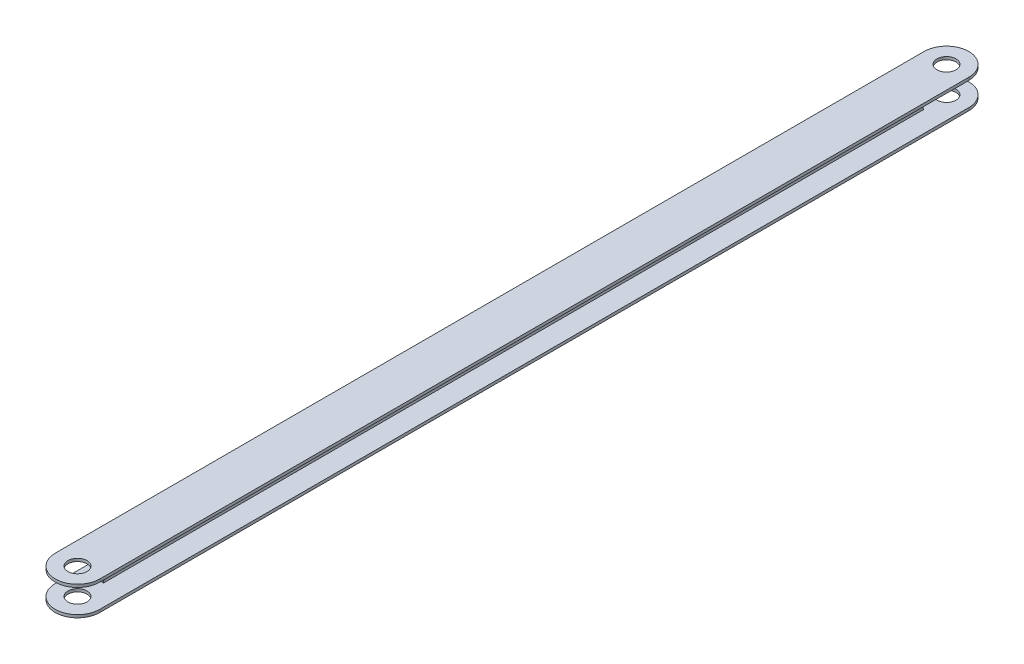
ISO-10303-21;
HEADER;
FILE_DESCRIPTION(('STEP AP214'),'2;1');
FILE_NAME('part.step','',(''),(''),'','','');
FILE_SCHEMA(('AUTOMOTIVE_DESIGN { 1 0 10303 214 1 1 1 1 }'));
ENDSEC;
DATA;
#1=APPLICATION_CONTEXT('core data for automotive mechanical design processes');
#2=APPLICATION_PROTOCOL_DEFINITION('international standard','automotive_design',2000,#1);
#3=PRODUCT_CONTEXT('',#1,'mechanical');
#4=PRODUCT('Part','Part','',(#3));
#5=PRODUCT_RELATED_PRODUCT_CATEGORY('part','',(#4));
#6=PRODUCT_DEFINITION_FORMATION('','',#4);
#7=PRODUCT_DEFINITION_CONTEXT('part definition',#1,'design');
#8=PRODUCT_DEFINITION('design','',#6,#7);
#9=PRODUCT_DEFINITION_SHAPE('','',#8);
#10=(LENGTH_UNIT() NAMED_UNIT(*) SI_UNIT(.MILLI.,.METRE.));
#11=(NAMED_UNIT(*) PLANE_ANGLE_UNIT() SI_UNIT($,.RADIAN.));
#12=(NAMED_UNIT(*) SI_UNIT($,.STERADIAN.) SOLID_ANGLE_UNIT());
#13=UNCERTAINTY_MEASURE_WITH_UNIT(LENGTH_MEASURE(1.E-05),#10,'distance_accuracy_value','');
#14=(GEOMETRIC_REPRESENTATION_CONTEXT(3) GLOBAL_UNCERTAINTY_ASSIGNED_CONTEXT((#13)) GLOBAL_UNIT_ASSIGNED_CONTEXT((#10,
#11,#12)) REPRESENTATION_CONTEXT('',''));
#15=CARTESIAN_POINT('',(0.,0.,0.));
#16=DIRECTION('',(0.,0.,1.));
#17=DIRECTION('',(1.,0.,0.));
#18=AXIS2_PLACEMENT_3D('',#15,#16,#17);
#19=CARTESIAN_POINT('',(-0.599999999999684,1.66533453693773E-12,389.000000000002));
#20=DIRECTION('',(1.,0.,0.));
#21=DIRECTION('',(0.,0.999999999999998,0.));
#22=AXIS2_PLACEMENT_3D('',#19,#20,#21);
#23=PLANE('',#22);
#24=DIRECTION('',(0.,0.999999999999998,0.));
#25=VECTOR('',#24,1.);
#26=CARTESIAN_POINT('',(-0.599999999999684,1.66533453693773E-12,369.000000000002));
#27=LINE('',#26,#25);
#28=CARTESIAN_POINT('',(-0.599999999999629,-5.,369.000000000002));
#29=VERTEX_POINT('',#28);
#30=CARTESIAN_POINT('',(-0.599999999999462,-4.51763554259088,369.000000000002));
#31=VERTEX_POINT('',#30);
#32=EDGE_CURVE('E232',#29,#31,#27,.T.);
#33=ORIENTED_EDGE('',*,*,#32,.T.);
#34=CARTESIAN_POINT('',(-0.599999999999823,-4.51763554259244,368.000000000002));
#35=DIRECTION('',(1.,0.,0.));
#36=DIRECTION('',(0.,-0.999999999999998,0.));
#37=AXIS2_PLACEMENT_3D('',#34,#35,#36);
#38=CIRCLE('',#37,1.);
#39=CARTESIAN_POINT('',(-0.599999999999656,-3.61410843407284,368.428530937243));
#40=VERTEX_POINT('',#39);
#41=EDGE_CURVE('E516',#31,#40,#38,.F.);
#42=ORIENTED_EDGE('',*,*,#41,.T.);
#43=CARTESIAN_POINT('',(-0.599999999999656,1.55431223447522E-12,370.142654686205));
#44=DIRECTION('',(1.,0.,0.));
#45=DIRECTION('',(0.,-0.999999999999998,0.));
#46=AXIS2_PLACEMENT_3D('',#43,#44,#45);
#47=CIRCLE('',#46,4.);
#48=CARTESIAN_POINT('',(-0.599999999999906,3.61410843407561,368.428530937242));
#49=VERTEX_POINT('',#48);
#50=EDGE_CURVE('E286',#40,#49,#47,.T.);
#51=ORIENTED_EDGE('',*,*,#50,.T.);
#52=CARTESIAN_POINT('',(-0.599999999999379,4.5176355425941,368.000000000002));
#53=DIRECTION('',(1.,0.,0.));
#54=DIRECTION('',(0.,-0.999999999999998,0.));
#55=AXIS2_PLACEMENT_3D('',#52,#53,#54);
#56=CIRCLE('',#55,1.);
#57=CARTESIAN_POINT('',(-0.599999999999296,4.5176355425941,369.000000000002));
#58=VERTEX_POINT('',#57);
#59=EDGE_CURVE('E241',#49,#58,#56,.F.);
#60=ORIENTED_EDGE('',*,*,#59,.T.);
#61=DIRECTION('',(0.,0.999999999999998,0.));
#62=VECTOR('',#61,1.);
#63=CARTESIAN_POINT('',(-0.599999999999684,1.66533453693773E-12,369.000000000002));
#64=LINE('',#63,#62);
#65=CARTESIAN_POINT('',(-0.599999999998851,5.,369.000000000002));
#66=VERTEX_POINT('',#65);
#67=EDGE_CURVE('E224',#58,#66,#64,.T.);
#68=ORIENTED_EDGE('',*,*,#67,.T.);
#69=DIRECTION('',(0.,0.,-1.00000000000001));
#70=VECTOR('',#69,1.);
#71=CARTESIAN_POINT('',(-0.59999999999924,5.00000000000167,389.000000000002));
#72=LINE('',#71,#70);
#73=CARTESIAN_POINT('',(-0.599999999999684,5.00000000000167,20.));
#74=VERTEX_POINT('',#73);
#75=EDGE_CURVE('E237',#66,#74,#72,.T.);
#76=ORIENTED_EDGE('',*,*,#75,.T.);
#77=DIRECTION('',(0.,0.999999999999998,0.));
#78=VECTOR('',#77,1.);
#79=CARTESIAN_POINT('',(-0.600000000000017,1.66533453693773E-12,20.0000000000005));
#80=LINE('',#79,#78);
#81=CARTESIAN_POINT('',(-0.600000000000156,4.5176355425941,20.0000000000007));
#82=VERTEX_POINT('',#81);
#83=EDGE_CURVE('E309',#82,#74,#80,.T.);
#84=ORIENTED_EDGE('',*,*,#83,.F.);
#85=CARTESIAN_POINT('',(-0.599999999999962,4.51763554259421,21.0000000000004));
#86=DIRECTION('',(-1.,0.,0.));
#87=DIRECTION('',(0.,-0.999999999999998,0.));
#88=AXIS2_PLACEMENT_3D('',#85,#86,#87);
#89=CIRCLE('',#88,1.);
#90=CARTESIAN_POINT('',(-0.599999999999851,3.61410843407406,20.5714690627595));
#91=VERTEX_POINT('',#90);
#92=EDGE_CURVE('E306',#91,#82,#89,.F.);
#93=ORIENTED_EDGE('',*,*,#92,.F.);
#94=CARTESIAN_POINT('',(-0.600000000000156,1.66533453693773E-12,18.857345313798));
#95=DIRECTION('',(-1.,0.,0.));
#96=DIRECTION('',(0.,-0.999999999999998,0.));
#97=AXIS2_PLACEMENT_3D('',#94,#95,#96);
#98=CIRCLE('',#97,4.);
#99=CARTESIAN_POINT('',(-0.599999999999989,-3.61410843407239,20.5714690627596));
#100=VERTEX_POINT('',#99);
#101=EDGE_CURVE('E303',#100,#91,#98,.T.);
#102=ORIENTED_EDGE('',*,*,#101,.F.);
#103=CARTESIAN_POINT('',(-0.600000000000017,-4.51763554259088,21.0000000000009));
#104=DIRECTION('',(-1.,0.,0.));
#105=DIRECTION('',(0.,-0.999999999999998,0.));
#106=AXIS2_PLACEMENT_3D('',#103,#104,#105);
#107=CIRCLE('',#106,1.);
#108=CARTESIAN_POINT('',(-0.599999999999906,-4.51763554259077,20.0000000000002));
#109=VERTEX_POINT('',#108);
#110=EDGE_CURVE('E300',#109,#100,#107,.F.);
#111=ORIENTED_EDGE('',*,*,#110,.F.);
#112=DIRECTION('',(0.,0.999999999999998,0.));
#113=VECTOR('',#112,1.);
#114=CARTESIAN_POINT('',(-0.600000000000017,1.66533453693773E-12,20.0000000000005));
#115=LINE('',#114,#113);
#116=CARTESIAN_POINT('',(-0.599999999999989,-5.,20.));
#117=VERTEX_POINT('',#116);
#118=EDGE_CURVE('E297',#117,#109,#115,.T.);
#119=ORIENTED_EDGE('',*,*,#118,.F.);
#120=DIRECTION('',(0.,0.,-1.00000000000001));
#121=VECTOR('',#120,1.);
#122=CARTESIAN_POINT('',(-0.599999999999684,-4.99999999999834,389.000000000002));
#123=LINE('',#122,#121);
#124=EDGE_CURVE('E249',#29,#117,#123,.T.);
#125=ORIENTED_EDGE('',*,*,#124,.F.);
#126=EDGE_LOOP('',(#33,#42,#51,#60,#68,#76,#84,#93,#102,#111,#119,#125));
#127=FACE_BOUND('',#126,.T.);
#128=ADVANCED_FACE('F81',(#127),#23,.F.);
#129=CARTESIAN_POINT('',(0.600000000000572,0.,389.000000000002));
#130=DIRECTION('',(1.,0.,0.));
#131=DIRECTION('',(0.,0.999999999999998,0.));
#132=AXIS2_PLACEMENT_3D('',#129,#130,#131);
#133=PLANE('',#132);
#134=CARTESIAN_POINT('',(0.600000000000322,-4.51763554259188,368.000000000002));
#135=DIRECTION('',(1.,0.,0.));
#136=DIRECTION('',(0.,0.999999999999998,0.));
#137=AXIS2_PLACEMENT_3D('',#134,#135,#136);
#138=CIRCLE('',#137,1.);
#139=CARTESIAN_POINT('',(0.600000000000739,-3.61410843407228,368.428530937243));
#140=VERTEX_POINT('',#139);
#141=CARTESIAN_POINT('',(0.600000000000322,-4.51763554259088,369.000000000001));
#142=VERTEX_POINT('',#141);
#143=EDGE_CURVE('E89',#140,#142,#138,.T.);
#144=ORIENTED_EDGE('',*,*,#143,.T.);
#145=DIRECTION('',(0.,-0.999999999999998,0.));
#146=VECTOR('',#145,1.);
#147=CARTESIAN_POINT('',(0.600000000000822,1.66533453693773E-12,369.000000000001));
#148=LINE('',#147,#146);
#149=CARTESIAN_POINT('',(0.600000000000739,-5.,369.000000000001));
#150=VERTEX_POINT('',#149);
#151=EDGE_CURVE('E14',#142,#150,#148,.T.);
#152=ORIENTED_EDGE('',*,*,#151,.T.);
#153=DIRECTION('',(0.,0.,-1.00000000000001));
#154=VECTOR('',#153,1.);
#155=CARTESIAN_POINT('',(0.600000000000572,-5.,389.000000000002));
#156=LINE('',#155,#154);
#157=CARTESIAN_POINT('',(0.600000000000572,-5.,20.0000000000008));
#158=VERTEX_POINT('',#157);
#159=EDGE_CURVE('E388',#150,#158,#156,.T.);
#160=ORIENTED_EDGE('',*,*,#159,.T.);
#161=DIRECTION('',(0.,-0.999999999999998,0.));
#162=VECTOR('',#161,1.);
#163=CARTESIAN_POINT('',(0.600000000000461,1.66533453693773E-12,20.0000000000012));
#164=LINE('',#163,#162);
#165=CARTESIAN_POINT('',(0.59999999999974,-4.51763554259255,20.0000000000008));
#166=VERTEX_POINT('',#165);
#167=EDGE_CURVE('E252',#166,#158,#164,.T.);
#168=ORIENTED_EDGE('',*,*,#167,.F.);
#169=CARTESIAN_POINT('',(0.600000000000406,-4.51763554259244,21.));
#170=DIRECTION('',(1.,0.,0.));
#171=DIRECTION('',(0.,0.999999999999998,0.));
#172=AXIS2_PLACEMENT_3D('',#169,#170,#171);
#173=CIRCLE('',#172,1.);
#174=CARTESIAN_POINT('',(0.600000000000406,-3.61410843407395,20.5714690627605));
#175=VERTEX_POINT('',#174);
#176=EDGE_CURVE('E260',#175,#166,#173,.F.);
#177=ORIENTED_EDGE('',*,*,#176,.F.);
#178=CARTESIAN_POINT('',(0.600000000000378,1.11022302462516E-12,18.8573453137987));
#179=DIRECTION('',(1.,0.,0.));
#180=DIRECTION('',(0.,0.999999999999998,0.));
#181=AXIS2_PLACEMENT_3D('',#178,#179,#180);
#182=CIRCLE('',#181,4.);
#183=CARTESIAN_POINT('',(0.6000000000006,3.61410843407561,20.5714690627596));
#184=VERTEX_POINT('',#183);
#185=EDGE_CURVE('E262',#184,#175,#182,.T.);
#186=ORIENTED_EDGE('',*,*,#185,.F.);
#187=CARTESIAN_POINT('',(0.600000000000406,4.51763554259421,21.0000000000003));
#188=DIRECTION('',(1.,0.,0.));
#189=DIRECTION('',(0.,0.999999999999998,0.));
#190=AXIS2_PLACEMENT_3D('',#187,#188,#189);
#191=CIRCLE('',#190,1.);
#192=CARTESIAN_POINT('',(0.600000000000017,4.5176355425941,20.0000000000006));
#193=VERTEX_POINT('',#192);
#194=EDGE_CURVE('E264',#193,#184,#191,.F.);
#195=ORIENTED_EDGE('',*,*,#194,.F.);
#196=DIRECTION('',(0.,-0.999999999999998,0.));
#197=VECTOR('',#196,1.);
#198=CARTESIAN_POINT('',(0.600000000000461,1.66533453693773E-12,20.0000000000012));
#199=LINE('',#198,#197);
#200=CARTESIAN_POINT('',(0.600000000000156,5.,20.0000000000008));
#201=VERTEX_POINT('',#200);
#202=EDGE_CURVE('E313',#201,#193,#199,.T.);
#203=ORIENTED_EDGE('',*,*,#202,.F.);
#204=DIRECTION('',(0.,0.,-1.00000000000001));
#205=VECTOR('',#204,1.);
#206=CARTESIAN_POINT('',(0.600000000000572,5.,389.000000000002));
#207=LINE('',#206,#205);
#208=CARTESIAN_POINT('',(0.600000000000739,5.,369.000000000002));
#209=VERTEX_POINT('',#208);
#210=EDGE_CURVE('E386',#209,#201,#207,.T.);
#211=ORIENTED_EDGE('',*,*,#210,.F.);
#212=DIRECTION('',(0.,-0.999999999999998,0.));
#213=VECTOR('',#212,1.);
#214=CARTESIAN_POINT('',(0.600000000000822,1.66533453693773E-12,369.000000000001));
#215=LINE('',#214,#213);
#216=CARTESIAN_POINT('',(0.600000000000322,4.51763554259255,369.000000000002));
#217=VERTEX_POINT('',#216);
#218=EDGE_CURVE('E227',#209,#217,#215,.T.);
#219=ORIENTED_EDGE('',*,*,#218,.T.);
#220=CARTESIAN_POINT('',(0.600000000000267,4.5176355425941,368.000000000001));
#221=DIRECTION('',(1.,0.,0.));
#222=DIRECTION('',(0.,0.999999999999998,0.));
#223=AXIS2_PLACEMENT_3D('',#220,#221,#222);
#224=CIRCLE('',#223,1.);
#225=CARTESIAN_POINT('',(0.600000000000406,3.61410843407561,368.428530937243));
#226=VERTEX_POINT('',#225);
#227=EDGE_CURVE('E266',#217,#226,#224,.T.);
#228=ORIENTED_EDGE('',*,*,#227,.T.);
#229=CARTESIAN_POINT('',(0.600000000000739,1.66533453693773E-12,370.142654686205));
#230=DIRECTION('',(1.,0.,0.));
#231=DIRECTION('',(0.,0.999999999999998,0.));
#232=AXIS2_PLACEMENT_3D('',#229,#230,#231);
#233=CIRCLE('',#232,4.);
#234=EDGE_CURVE('E269',#226,#140,#233,.F.);
#235=ORIENTED_EDGE('',*,*,#234,.T.);
#236=EDGE_LOOP('',(#144,#152,#160,#168,#177,#186,#195,#203,#211,#219,#228,#235));
#237=FACE_BOUND('',#236,.T.);
#238=ADVANCED_FACE('F273',(#237),#133,.T.);
#239=CARTESIAN_POINT('',(7.21644966006352E-13,-363.799999999999,379.500000000002));
#240=DIRECTION('',(0.,0.999999999999998,0.));
#241=DIRECTION('',(0.,0.,1.00000000000001));
#242=AXIS2_PLACEMENT_3D('',#239,#240,#241);
#243=CYLINDRICAL_SURFACE('',#242,9.49999999999999);
#244=CARTESIAN_POINT('',(1.38777878078145E-13,5.00000000000023,379.500000000003));
#245=DIRECTION('',(0.,0.999999999999998,0.));
#246=DIRECTION('',(0.,0.,1.00000000000001));
#247=AXIS2_PLACEMENT_3D('',#244,#245,#246);
#248=CIRCLE('',#247,9.49999999999999);
#249=CARTESIAN_POINT('',(9.5000000000007,5.00000000000167,379.500000000002));
#250=VERTEX_POINT('',#249);
#251=CARTESIAN_POINT('',(-9.49999999999962,5.,379.500000000003));
#252=VERTEX_POINT('',#251);
#253=EDGE_CURVE('E96',#250,#252,#248,.F.);
#254=ORIENTED_EDGE('',*,*,#253,.F.);
#255=DIRECTION('',(0.,0.999999999999998,0.));
#256=VECTOR('',#255,1.);
#257=CARTESIAN_POINT('',(9.50000000000068,-363.799999999998,379.500000000003));
#258=LINE('',#257,#256);
#259=CARTESIAN_POINT('',(9.50000000000034,6.19999999999998,379.500000000003));
#260=VERTEX_POINT('',#259);
#261=EDGE_CURVE('E331',#250,#260,#258,.T.);
#262=ORIENTED_EDGE('',*,*,#261,.T.);
#263=CARTESIAN_POINT('',(2.77555756156289E-13,6.20000000000154,379.500000000003));
#264=DIRECTION('',(0.,-0.999999999999998,0.));
#265=DIRECTION('',(0.,0.,-1.00000000000001));
#266=AXIS2_PLACEMENT_3D('',#263,#264,#265);
#267=CIRCLE('',#266,9.49999999999999);
#268=CARTESIAN_POINT('',(-9.49999999999912,6.20000000000165,379.500000000002));
#269=VERTEX_POINT('',#268);
#270=EDGE_CURVE('E328',#260,#269,#267,.T.);
#271=ORIENTED_EDGE('',*,*,#270,.T.);
#272=DIRECTION('',(0.,0.999999999999998,0.));
#273=VECTOR('',#272,1.);
#274=CARTESIAN_POINT('',(-9.49999999999962,-363.799999999999,379.500000000003));
#275=LINE('',#274,#273);
#276=EDGE_CURVE('E330',#252,#269,#275,.T.);
#277=ORIENTED_EDGE('',*,*,#276,.F.);
#278=EDGE_LOOP('',(#254,#262,#271,#277));
#279=FACE_BOUND('',#278,.T.);
#280=ADVANCED_FACE('F425',(#279),#243,.T.);
#281=CARTESIAN_POINT('',(7.21644966006352E-13,-363.799999999999,379.500000000002));
#282=DIRECTION('',(0.,0.999999999999998,0.));
#283=DIRECTION('',(0.,0.,1.00000000000001));
#284=AXIS2_PLACEMENT_3D('',#281,#282,#283);
#285=CYLINDRICAL_SURFACE('',#284,4.05);
#286=CARTESIAN_POINT('',(2.77555756156289E-13,6.20000000000154,379.500000000003));
#287=DIRECTION('',(0.,-0.999999999999998,0.));
#288=DIRECTION('',(0.,0.,-1.00000000000001));
#289=AXIS2_PLACEMENT_3D('',#286,#287,#288);
#290=CIRCLE('',#289,4.05);
#291=CARTESIAN_POINT('',(2.74732029186269E-13,6.20000000000154,375.450000000003));
#292=VERTEX_POINT('',#291);
#293=EDGE_CURVE('E325',#292,#292,#290,.T.);
#294=ORIENTED_EDGE('',*,*,#293,.F.);
#295=EDGE_LOOP('',(#294));
#296=FACE_BOUND('',#295,.T.);
#297=CARTESIAN_POINT('',(1.38777878078145E-13,5.00000000000023,379.500000000003));
#298=DIRECTION('',(0.,0.999999999999998,0.));
#299=DIRECTION('',(0.,0.,1.00000000000001));
#300=AXIS2_PLACEMENT_3D('',#297,#298,#299);
#301=CIRCLE('',#300,4.05);
#302=CARTESIAN_POINT('',(1.41601605048165E-13,5.00000000000023,383.550000000003));
#303=VERTEX_POINT('',#302);
#304=EDGE_CURVE('E348',#303,#303,#301,.F.);
#305=ORIENTED_EDGE('',*,*,#304,.T.);
#306=EDGE_LOOP('',(#305));
#307=FACE_BOUND('',#306,.T.);
#308=ADVANCED_FACE('F433',(#296,#307),#285,.F.);
#309=CARTESIAN_POINT('',(0.,-363.799999999999,9.49999999999967));
#310=DIRECTION('',(0.,0.999999999999998,0.));
#311=DIRECTION('',(0.,0.,1.00000000000001));
#312=AXIS2_PLACEMENT_3D('',#309,#310,#311);
#313=CYLINDRICAL_SURFACE('',#312,9.49999999999999);
#314=CARTESIAN_POINT('',(8.32667268468867E-13,-4.99999999999923,9.50000000000084));
#315=DIRECTION('',(0.,0.999999999999998,0.));
#316=DIRECTION('',(0.,0.,1.00000000000001));
#317=AXIS2_PLACEMENT_3D('',#314,#315,#316);
#318=CIRCLE('',#317,9.49999999999999);
#319=CARTESIAN_POINT('',(9.50000000000042,-4.99999999999834,9.50000000000017));
#320=VERTEX_POINT('',#319);
#321=CARTESIAN_POINT('',(-9.49999999999912,-5.,9.50000000000001));
#322=VERTEX_POINT('',#321);
#323=EDGE_CURVE('E367',#320,#322,#318,.T.);
#324=ORIENTED_EDGE('',*,*,#323,.F.);
#325=DIRECTION('',(0.,0.999999999999998,0.));
#326=VECTOR('',#325,1.);
#327=CARTESIAN_POINT('',(9.50000000000009,-363.799999999998,9.50000000000051));
#328=LINE('',#327,#326);
#329=CARTESIAN_POINT('',(9.5000000000002,-6.19999999999832,9.50000000000084));
#330=VERTEX_POINT('',#329);
#331=EDGE_CURVE('E361',#330,#320,#328,.T.);
#332=ORIENTED_EDGE('',*,*,#331,.F.);
#333=CARTESIAN_POINT('',(7.21644966006352E-13,-6.19999999999832,9.50000000000095));
#334=DIRECTION('',(0.,0.999999999999998,0.));
#335=DIRECTION('',(0.,0.,1.00000000000001));
#336=AXIS2_PLACEMENT_3D('',#333,#334,#335);
#337=CIRCLE('',#336,9.49999999999999);
#338=CARTESIAN_POINT('',(-9.49999999999973,-6.19999999999832,9.50000000000084));
#339=VERTEX_POINT('',#338);
#340=EDGE_CURVE('E364',#330,#339,#337,.T.);
#341=ORIENTED_EDGE('',*,*,#340,.T.);
#342=DIRECTION('',(0.,0.999999999999998,0.));
#343=VECTOR('',#342,1.);
#344=CARTESIAN_POINT('',(-9.49999999999995,-363.799999999999,9.5000000000009));
#345=LINE('',#344,#343);
#346=EDGE_CURVE('E360',#339,#322,#345,.T.);
#347=ORIENTED_EDGE('',*,*,#346,.T.);
#348=EDGE_LOOP('',(#324,#332,#341,#347));
#349=FACE_BOUND('',#348,.T.);
#350=ADVANCED_FACE('F405',(#349),#313,.T.);
#351=CARTESIAN_POINT('',(0.,-363.799999999999,9.49999999999967));
#352=DIRECTION('',(0.,0.999999999999998,0.));
#353=DIRECTION('',(0.,0.,1.00000000000001));
#354=AXIS2_PLACEMENT_3D('',#351,#352,#353);
#355=CYLINDRICAL_SURFACE('',#354,4.05);
#356=CARTESIAN_POINT('',(7.21644966006352E-13,-6.19999999999832,9.50000000000095));
#357=DIRECTION('',(0.,0.999999999999998,0.));
#358=DIRECTION('',(0.,0.,1.00000000000001));
#359=AXIS2_PLACEMENT_3D('',#356,#357,#358);
#360=CIRCLE('',#359,4.05);
#361=CARTESIAN_POINT('',(7.24468692976372E-13,-6.19999999999832,13.550000000001));
#362=VERTEX_POINT('',#361);
#363=EDGE_CURVE('E375',#362,#362,#360,.T.);
#364=ORIENTED_EDGE('',*,*,#363,.F.);
#365=EDGE_LOOP('',(#364));
#366=FACE_BOUND('',#365,.T.);
#367=CARTESIAN_POINT('',(8.32667268468867E-13,-4.99999999999923,9.50000000000084));
#368=DIRECTION('',(0.,0.999999999999998,0.));
#369=DIRECTION('',(0.,0.,1.00000000000001));
#370=AXIS2_PLACEMENT_3D('',#367,#368,#369);
#371=CIRCLE('',#370,4.05);
#372=CARTESIAN_POINT('',(8.35490995438888E-13,-4.99999999999923,13.5500000000009));
#373=VERTEX_POINT('',#372);
#374=EDGE_CURVE('E378',#373,#373,#371,.T.);
#375=ORIENTED_EDGE('',*,*,#374,.T.);
#376=EDGE_LOOP('',(#375));
#377=FACE_BOUND('',#376,.T.);
#378=ADVANCED_FACE('F437',(#366,#377),#355,.F.);
#379=CARTESIAN_POINT('',(4.9960036108132E-13,-6.19999999999998,389.000000000002));
#380=DIRECTION('',(0.,0.999999999999998,0.));
#381=DIRECTION('',(0.,0.,1.00000000000001));
#382=AXIS2_PLACEMENT_3D('',#379,#380,#381);
#383=PLANE('',#382);
#384=CARTESIAN_POINT('',(3.33066907387547E-13,-6.19999999999998,379.500000000003));
#385=DIRECTION('',(0.,0.999999999999998,0.));
#386=DIRECTION('',(0.,0.,1.00000000000001));
#387=AXIS2_PLACEMENT_3D('',#384,#385,#386);
#388=CIRCLE('',#387,4.05);
#389=CARTESIAN_POINT('',(3.35890634357567E-13,-6.19999999999998,383.550000000003));
#390=VERTEX_POINT('',#389);
#391=EDGE_CURVE('E345',#390,#390,#388,.F.);
#392=ORIENTED_EDGE('',*,*,#391,.F.);
#393=EDGE_LOOP('',(#392));
#394=FACE_BOUND('',#393,.T.);
#395=ORIENTED_EDGE('',*,*,#363,.T.);
#396=EDGE_LOOP('',(#395));
#397=FACE_BOUND('',#396,.T.);
#398=DIRECTION('',(0.,0.,-1.00000000000001));
#399=VECTOR('',#398,1.);
#400=CARTESIAN_POINT('',(9.50000000000076,-6.19999999999998,389.000000000002));
#401=LINE('',#400,#399);
#402=CARTESIAN_POINT('',(9.50000000000031,-6.19999999999998,379.500000000002));
#403=VERTEX_POINT('',#402);
#404=EDGE_CURVE('E392',#403,#330,#401,.T.);
#405=ORIENTED_EDGE('',*,*,#404,.F.);
#406=CARTESIAN_POINT('',(3.33066907387547E-13,-6.19999999999998,379.500000000003));
#407=DIRECTION('',(0.,0.999999999999998,0.));
#408=DIRECTION('',(0.,0.,1.00000000000001));
#409=AXIS2_PLACEMENT_3D('',#406,#407,#408);
#410=CIRCLE('',#409,9.49999999999999);
#411=CARTESIAN_POINT('',(-9.49999999999962,-6.19999999999998,379.500000000003));
#412=VERTEX_POINT('',#411);
#413=EDGE_CURVE('E336',#403,#412,#410,.F.);
#414=ORIENTED_EDGE('',*,*,#413,.T.);
#415=DIRECTION('',(0.,0.,-1.00000000000001));
#416=VECTOR('',#415,1.);
#417=CARTESIAN_POINT('',(-9.49999999999951,-6.19999999999887,389.000000000002));
#418=LINE('',#417,#416);
#419=EDGE_CURVE('E394',#412,#339,#418,.T.);
#420=ORIENTED_EDGE('',*,*,#419,.T.);
#421=ORIENTED_EDGE('',*,*,#340,.F.);
#422=EDGE_LOOP('',(#405,#414,#420,#421));
#423=FACE_BOUND('',#422,.T.);
#424=ADVANCED_FACE('F418',(#394,#397,#423),#383,.F.);
#425=CARTESIAN_POINT('',(3.60822483003176E-13,-4.99999999999834,389.000000000002));
#426=DIRECTION('',(0.,0.999999999999998,0.));
#427=DIRECTION('',(0.,0.,1.00000000000001));
#428=AXIS2_PLACEMENT_3D('',#425,#426,#427);
#429=PLANE('',#428);
#430=DIRECTION('',(0.,0.,-1.00000000000001));
#431=VECTOR('',#430,1.);
#432=CARTESIAN_POINT('',(9.50000000000087,-4.99999999999834,389.000000000002));
#433=LINE('',#432,#431);
#434=CARTESIAN_POINT('',(9.50000000000026,-4.99999999999834,379.500000000003));
#435=VERTEX_POINT('',#434);
#436=EDGE_CURVE('E390',#435,#320,#433,.T.);
#437=ORIENTED_EDGE('',*,*,#436,.T.);
#438=ORIENTED_EDGE('',*,*,#323,.T.);
#439=DIRECTION('',(0.,0.,-1.00000000000001));
#440=VECTOR('',#439,1.);
#441=CARTESIAN_POINT('',(-9.49999999999934,-4.99999999999834,389.000000000002));
#442=LINE('',#441,#440);
#443=CARTESIAN_POINT('',(-9.49999999999962,-4.99999999999901,379.500000000002));
#444=VERTEX_POINT('',#443);
#445=EDGE_CURVE('E254',#444,#322,#442,.T.);
#446=ORIENTED_EDGE('',*,*,#445,.F.);
#447=CARTESIAN_POINT('',(1.94289029309402E-13,-4.99999999999834,379.500000000003));
#448=DIRECTION('',(0.,0.999999999999998,0.));
#449=DIRECTION('',(0.,0.,1.00000000000001));
#450=AXIS2_PLACEMENT_3D('',#447,#448,#449);
#451=CIRCLE('',#450,9.49999999999999);
#452=EDGE_CURVE('E339',#435,#444,#451,.F.);
#453=ORIENTED_EDGE('',*,*,#452,.F.);
#454=EDGE_LOOP('',(#437,#438,#446,#453));
#455=FACE_BOUND('',#454,.T.);
#456=DIRECTION('',(-1.,0.,0.));
#457=VECTOR('',#456,1.);
#458=CARTESIAN_POINT('',(369.400000000002,-4.99999999999989,369.000000000001));
#459=LINE('',#458,#457);
#460=EDGE_CURVE('E290',#150,#29,#459,.T.);
#461=ORIENTED_EDGE('',*,*,#460,.T.);
#462=ORIENTED_EDGE('',*,*,#124,.T.);
#463=DIRECTION('',(-1.,0.,0.));
#464=VECTOR('',#463,1.);
#465=CARTESIAN_POINT('',(369.400000000002,-4.99999999999978,19.9999999999995));
#466=LINE('',#465,#464);
#467=EDGE_CURVE('E311',#158,#117,#466,.T.);
#468=ORIENTED_EDGE('',*,*,#467,.F.);
#469=ORIENTED_EDGE('',*,*,#159,.F.);
#470=EDGE_LOOP('',(#461,#462,#468,#469));
#471=FACE_BOUND('',#470,.T.);
#472=CARTESIAN_POINT('',(1.94289029309402E-13,-4.99999999999834,379.500000000003));
#473=DIRECTION('',(0.,0.999999999999998,0.));
#474=DIRECTION('',(0.,0.,1.00000000000001));
#475=AXIS2_PLACEMENT_3D('',#472,#473,#474);
#476=CIRCLE('',#475,4.05);
#477=CARTESIAN_POINT('',(1.97112756279423E-13,-4.99999999999834,383.550000000003));
#478=VERTEX_POINT('',#477);
#479=EDGE_CURVE('E342',#478,#478,#476,.F.);
#480=ORIENTED_EDGE('',*,*,#479,.T.);
#481=EDGE_LOOP('',(#480));
#482=FACE_BOUND('',#481,.T.);
#483=ORIENTED_EDGE('',*,*,#374,.F.);
#484=EDGE_LOOP('',(#483));
#485=FACE_BOUND('',#484,.T.);
#486=ADVANCED_FACE('F409',(#455,#471,#482,#485),#429,.T.);
#487=CARTESIAN_POINT('',(1.13797860024079E-12,5.00000000000045,389.000000000002));
#488=DIRECTION('',(0.,0.999999999999998,0.));
#489=DIRECTION('',(0.,0.,1.00000000000001));
#490=AXIS2_PLACEMENT_3D('',#487,#488,#489);
#491=PLANE('',#490);
#492=DIRECTION('',(-1.,0.,0.));
#493=VECTOR('',#492,1.);
#494=CARTESIAN_POINT('',(369.400000000002,5.00000000000078,369.000000000002));
#495=LINE('',#494,#493);
#496=EDGE_CURVE('E220',#209,#66,#495,.T.);
#497=ORIENTED_EDGE('',*,*,#496,.F.);
#498=ORIENTED_EDGE('',*,*,#210,.T.);
#499=DIRECTION('',(-1.,0.,0.));
#500=VECTOR('',#499,1.);
#501=CARTESIAN_POINT('',(369.400000000002,5.00000000000167,20.000000000001));
#502=LINE('',#501,#500);
#503=EDGE_CURVE('E246',#201,#74,#502,.T.);
#504=ORIENTED_EDGE('',*,*,#503,.T.);
#505=ORIENTED_EDGE('',*,*,#75,.F.);
#506=EDGE_LOOP('',(#497,#498,#504,#505));
#507=FACE_BOUND('',#506,.T.);
#508=ORIENTED_EDGE('',*,*,#304,.F.);
#509=EDGE_LOOP('',(#508));
#510=FACE_BOUND('',#509,.T.);
#511=DIRECTION('',(0.,0.,-1.00000000000001));
#512=VECTOR('',#511,1.);
#513=CARTESIAN_POINT('',(9.5000000000004,5.00000000000167,389.000000000002));
#514=LINE('',#513,#512);
#515=CARTESIAN_POINT('',(9.50000000000042,5.00000000000034,9.50000000000084));
#516=VERTEX_POINT('',#515);
#517=EDGE_CURVE('E384',#250,#516,#514,.T.);
#518=ORIENTED_EDGE('',*,*,#517,.F.);
#519=ORIENTED_EDGE('',*,*,#253,.T.);
#520=DIRECTION('',(0.,0.,-1.00000000000001));
#521=VECTOR('',#520,1.);
#522=CARTESIAN_POINT('',(-9.49999999999856,5.,389.000000000002));
#523=LINE('',#522,#521);
#524=CARTESIAN_POINT('',(-9.49999999999918,5.,9.50000000000001));
#525=VERTEX_POINT('',#524);
#526=EDGE_CURVE('E248',#252,#525,#523,.T.);
#527=ORIENTED_EDGE('',*,*,#526,.T.);
#528=CARTESIAN_POINT('',(8.32667268468867E-13,5.,9.50000000000079));
#529=DIRECTION('',(0.,0.999999999999998,0.));
#530=DIRECTION('',(0.,0.,1.00000000000001));
#531=AXIS2_PLACEMENT_3D('',#528,#529,#530);
#532=CIRCLE('',#531,9.49999999999999);
#533=EDGE_CURVE('E368',#516,#525,#532,.T.);
#534=ORIENTED_EDGE('',*,*,#533,.F.);
#535=EDGE_LOOP('',(#518,#519,#527,#534));
#536=FACE_BOUND('',#535,.T.);
#537=CARTESIAN_POINT('',(8.32667268468867E-13,5.,9.50000000000079));
#538=DIRECTION('',(0.,0.999999999999998,0.));
#539=DIRECTION('',(0.,0.,1.00000000000001));
#540=AXIS2_PLACEMENT_3D('',#537,#538,#539);
#541=CIRCLE('',#540,4.05);
#542=CARTESIAN_POINT('',(8.35490995438888E-13,5.,13.5500000000008));
#543=VERTEX_POINT('',#542);
#544=EDGE_CURVE('E372',#543,#543,#541,.T.);
#545=ORIENTED_EDGE('',*,*,#544,.T.);
#546=EDGE_LOOP('',(#545));
#547=FACE_BOUND('',#546,.T.);
#548=ADVANCED_FACE('F243',(#507,#510,#536,#547),#491,.F.);
#549=CARTESIAN_POINT('',(1.22124532708767E-12,6.20000000000165,389.000000000002));
#550=DIRECTION('',(0.,0.999999999999998,0.));
#551=DIRECTION('',(0.,0.,1.00000000000001));
#552=AXIS2_PLACEMENT_3D('',#549,#550,#551);
#553=PLANE('',#552);
#554=ORIENTED_EDGE('',*,*,#293,.T.);
#555=EDGE_LOOP('',(#554));
#556=FACE_BOUND('',#555,.T.);
#557=CARTESIAN_POINT('',(1.66533453693773E-13,6.20000000000009,9.50000000000084));
#558=DIRECTION('',(0.,0.999999999999998,0.));
#559=DIRECTION('',(0.,0.,1.00000000000001));
#560=AXIS2_PLACEMENT_3D('',#557,#558,#559);
#561=CIRCLE('',#560,4.05);
#562=CARTESIAN_POINT('',(1.69357180663794E-13,6.20000000000009,13.5500000000009));
#563=VERTEX_POINT('',#562);
#564=EDGE_CURVE('E351',#563,#563,#561,.T.);
#565=ORIENTED_EDGE('',*,*,#564,.F.);
#566=EDGE_LOOP('',(#565));
#567=FACE_BOUND('',#566,.T.);
#568=DIRECTION('',(0.,0.,-1.00000000000001));
#569=VECTOR('',#568,1.);
#570=CARTESIAN_POINT('',(-9.49999999999923,6.20000000000165,389.000000000002));
#571=LINE('',#570,#569);
#572=CARTESIAN_POINT('',(-9.49999999999979,6.20000000000165,9.50000000000001));
#573=VERTEX_POINT('',#572);
#574=EDGE_CURVE('E104',#269,#573,#571,.T.);
#575=ORIENTED_EDGE('',*,*,#574,.F.);
#576=ORIENTED_EDGE('',*,*,#270,.F.);
#577=DIRECTION('',(0.,0.,-1.00000000000001));
#578=VECTOR('',#577,1.);
#579=CARTESIAN_POINT('',(9.50000000000042,6.20000000000165,389.000000000002));
#580=LINE('',#579,#578);
#581=CARTESIAN_POINT('',(9.49999999999998,6.19999999999998,9.50000000000162));
#582=VERTEX_POINT('',#581);
#583=EDGE_CURVE('E382',#260,#582,#580,.T.);
#584=ORIENTED_EDGE('',*,*,#583,.T.);
#585=CARTESIAN_POINT('',(1.66533453693773E-13,6.20000000000009,9.50000000000084));
#586=DIRECTION('',(0.,0.999999999999998,0.));
#587=DIRECTION('',(0.,0.,1.00000000000001));
#588=AXIS2_PLACEMENT_3D('',#585,#586,#587);
#589=CIRCLE('',#588,9.49999999999999);
#590=EDGE_CURVE('E354',#582,#573,#589,.T.);
#591=ORIENTED_EDGE('',*,*,#590,.T.);
#592=EDGE_LOOP('',(#575,#576,#584,#591));
#593=FACE_BOUND('',#592,.T.);
#594=ADVANCED_FACE('F457',(#556,#567,#593),#553,.T.);
#595=CARTESIAN_POINT('',(-9.49999999999967,2.22044604925031E-13,389.000000000002));
#596=DIRECTION('',(-1.,0.,0.));
#597=DIRECTION('',(0.,-0.999999999999998,0.));
#598=AXIS2_PLACEMENT_3D('',#595,#596,#597);
#599=PLANE('',#598);
#600=ORIENTED_EDGE('',*,*,#526,.F.);
#601=ORIENTED_EDGE('',*,*,#276,.T.);
#602=ORIENTED_EDGE('',*,*,#574,.T.);
#603=EDGE_CURVE('E358',#525,#573,#345,.T.);
#604=ORIENTED_EDGE('',*,*,#603,.F.);
#605=EDGE_LOOP('',(#600,#601,#602,#604));
#606=FACE_BOUND('',#605,.T.);
#607=ADVANCED_FACE('F83',(#606),#599,.T.);
#608=CARTESIAN_POINT('',(-9.49999999999967,2.22044604925031E-13,389.000000000002));
#609=DIRECTION('',(1.,0.,0.));
#610=DIRECTION('',(0.,1.,0.));
#611=AXIS2_PLACEMENT_3D('',#608,#609,#610);
#612=PLANE('',#611);
#613=EDGE_CURVE('E334',#412,#444,#275,.T.);
#614=ORIENTED_EDGE('',*,*,#613,.T.);
#615=ORIENTED_EDGE('',*,*,#445,.T.);
#616=ORIENTED_EDGE('',*,*,#346,.F.);
#617=ORIENTED_EDGE('',*,*,#419,.F.);
#618=EDGE_LOOP('',(#614,#615,#616,#617));
#619=FACE_BOUND('',#618,.T.);
#620=ADVANCED_FACE('F400',(#619),#612,.F.);
#621=CARTESIAN_POINT('',(9.50000000000059,1.66533453693773E-12,389.000000000002));
#622=DIRECTION('',(1.,0.,0.));
#623=DIRECTION('',(0.,0.,-1.00000000000001));
#624=AXIS2_PLACEMENT_3D('',#621,#622,#623);
#625=PLANE('',#624);
#626=ORIENTED_EDGE('',*,*,#436,.F.);
#627=EDGE_CURVE('E333',#403,#435,#258,.T.);
#628=ORIENTED_EDGE('',*,*,#627,.F.);
#629=ORIENTED_EDGE('',*,*,#404,.T.);
#630=ORIENTED_EDGE('',*,*,#331,.T.);
#631=EDGE_LOOP('',(#626,#628,#629,#630));
#632=FACE_BOUND('',#631,.T.);
#633=ADVANCED_FACE('F415',(#632),#625,.T.);
#634=CARTESIAN_POINT('',(9.50000000000059,1.66533453693773E-12,389.000000000002));
#635=DIRECTION('',(-1.,0.,0.));
#636=DIRECTION('',(0.,0.,1.00000000000001));
#637=AXIS2_PLACEMENT_3D('',#634,#635,#636);
#638=PLANE('',#637);
#639=ORIENTED_EDGE('',*,*,#261,.F.);
#640=ORIENTED_EDGE('',*,*,#517,.T.);
#641=EDGE_CURVE('E357',#516,#582,#328,.T.);
#642=ORIENTED_EDGE('',*,*,#641,.T.);
#643=ORIENTED_EDGE('',*,*,#583,.F.);
#644=EDGE_LOOP('',(#639,#640,#642,#643));
#645=FACE_BOUND('',#644,.T.);
#646=ADVANCED_FACE('F452',(#645),#638,.F.);
#647=ORIENTED_EDGE('',*,*,#533,.T.);
#648=ORIENTED_EDGE('',*,*,#603,.T.);
#649=ORIENTED_EDGE('',*,*,#590,.F.);
#650=ORIENTED_EDGE('',*,*,#641,.F.);
#651=EDGE_LOOP('',(#647,#648,#649,#650));
#652=FACE_BOUND('',#651,.T.);
#653=ADVANCED_FACE('F434',(#652),#313,.T.);
#654=ORIENTED_EDGE('',*,*,#564,.T.);
#655=EDGE_LOOP('',(#654));
#656=FACE_BOUND('',#655,.T.);
#657=ORIENTED_EDGE('',*,*,#544,.F.);
#658=EDGE_LOOP('',(#657));
#659=FACE_BOUND('',#658,.T.);
#660=ADVANCED_FACE('F423',(#656,#659),#355,.F.);
#661=ORIENTED_EDGE('',*,*,#627,.T.);
#662=ORIENTED_EDGE('',*,*,#452,.T.);
#663=ORIENTED_EDGE('',*,*,#613,.F.);
#664=ORIENTED_EDGE('',*,*,#413,.F.);
#665=EDGE_LOOP('',(#661,#662,#663,#664));
#666=FACE_BOUND('',#665,.T.);
#667=ADVANCED_FACE('F420',(#666),#243,.T.);
#668=ORIENTED_EDGE('',*,*,#479,.F.);
#669=EDGE_LOOP('',(#668));
#670=FACE_BOUND('',#669,.T.);
#671=ORIENTED_EDGE('',*,*,#391,.T.);
#672=EDGE_LOOP('',(#671));
#673=FACE_BOUND('',#672,.T.);
#674=ADVANCED_FACE('F422',(#670,#673),#285,.F.);
#675=CARTESIAN_POINT('',(369.400000000002,0.,20.0000000000012));
#676=DIRECTION('',(0.,0.,1.00000000000001));
#677=DIRECTION('',(1.,0.,0.));
#678=AXIS2_PLACEMENT_3D('',#675,#676,#677);
#679=PLANE('',#678);
#680=ORIENTED_EDGE('',*,*,#167,.T.);
#681=ORIENTED_EDGE('',*,*,#467,.T.);
#682=ORIENTED_EDGE('',*,*,#118,.T.);
#683=DIRECTION('',(-1.,0.,0.));
#684=VECTOR('',#683,1.);
#685=CARTESIAN_POINT('',(369.400000000002,-4.51763554259244,20.0000000000012));
#686=LINE('',#685,#684);
#687=EDGE_CURVE('E320',#166,#109,#686,.T.);
#688=ORIENTED_EDGE('',*,*,#687,.F.);
#689=EDGE_LOOP('',(#680,#681,#682,#688));
#690=FACE_BOUND('',#689,.T.);
#691=ADVANCED_FACE('F430',(#690),#679,.F.);
#692=CARTESIAN_POINT('',(369.400000000002,-4.51763554259077,21.0000000000004));
#693=DIRECTION('',(-1.,0.,0.));
#694=DIRECTION('',(0.,-0.999999999999998,0.));
#695=AXIS2_PLACEMENT_3D('',#692,#693,#694);
#696=CYLINDRICAL_SURFACE('',#695,1.);
#697=ORIENTED_EDGE('',*,*,#176,.T.);
#698=ORIENTED_EDGE('',*,*,#687,.T.);
#699=ORIENTED_EDGE('',*,*,#110,.T.);
#700=DIRECTION('',(-1.,0.,0.));
#701=VECTOR('',#700,1.);
#702=CARTESIAN_POINT('',(369.400000000002,-3.61410843407228,20.5714690627605));
#703=LINE('',#702,#701);
#704=EDGE_CURVE('E318',#175,#100,#703,.T.);
#705=ORIENTED_EDGE('',*,*,#704,.F.);
#706=EDGE_LOOP('',(#697,#698,#699,#705));
#707=FACE_BOUND('',#706,.T.);
#708=ADVANCED_FACE('F482',(#707),#696,.T.);
#709=CARTESIAN_POINT('',(369.400000000002,8.88178419700125E-13,18.857345313798));
#710=DIRECTION('',(-1.,0.,0.));
#711=DIRECTION('',(0.,-0.999999999999998,0.));
#712=AXIS2_PLACEMENT_3D('',#709,#710,#711);
#713=CYLINDRICAL_SURFACE('',#712,4.);
#714=ORIENTED_EDGE('',*,*,#185,.T.);
#715=ORIENTED_EDGE('',*,*,#704,.T.);
#716=ORIENTED_EDGE('',*,*,#101,.T.);
#717=DIRECTION('',(-1.,0.,0.));
#718=VECTOR('',#717,1.);
#719=CARTESIAN_POINT('',(369.400000000002,3.61410843407572,20.5714690627607));
#720=LINE('',#719,#718);
#721=EDGE_CURVE('E316',#184,#91,#720,.T.);
#722=ORIENTED_EDGE('',*,*,#721,.F.);
#723=EDGE_LOOP('',(#714,#715,#716,#722));
#724=FACE_BOUND('',#723,.T.);
#725=ADVANCED_FACE('F486',(#724),#713,.F.);
#726=CARTESIAN_POINT('',(369.400000000002,4.51763554259377,21.0000000000011));
#727=DIRECTION('',(-1.,0.,0.));
#728=DIRECTION('',(0.,-0.999999999999998,0.));
#729=AXIS2_PLACEMENT_3D('',#726,#727,#728);
#730=CYLINDRICAL_SURFACE('',#729,1.);
#731=ORIENTED_EDGE('',*,*,#194,.T.);
#732=ORIENTED_EDGE('',*,*,#721,.T.);
#733=ORIENTED_EDGE('',*,*,#92,.T.);
#734=DIRECTION('',(-1.,0.,0.));
#735=VECTOR('',#734,1.);
#736=CARTESIAN_POINT('',(369.400000000002,4.51763554259421,20.0000000000012));
#737=LINE('',#736,#735);
#738=EDGE_CURVE('E314',#193,#82,#737,.T.);
#739=ORIENTED_EDGE('',*,*,#738,.F.);
#740=EDGE_LOOP('',(#731,#732,#733,#739));
#741=FACE_BOUND('',#740,.T.);
#742=ADVANCED_FACE('F490',(#741),#730,.T.);
#743=CARTESIAN_POINT('',(369.400000000002,0.,20.0000000000012));
#744=DIRECTION('',(0.,0.,1.00000000000001));
#745=DIRECTION('',(1.,0.,0.));
#746=AXIS2_PLACEMENT_3D('',#743,#744,#745);
#747=PLANE('',#746);
#748=ORIENTED_EDGE('',*,*,#202,.T.);
#749=ORIENTED_EDGE('',*,*,#738,.T.);
#750=ORIENTED_EDGE('',*,*,#83,.T.);
#751=ORIENTED_EDGE('',*,*,#503,.F.);
#752=EDGE_LOOP('',(#748,#749,#750,#751));
#753=FACE_BOUND('',#752,.T.);
#754=ADVANCED_FACE('F494',(#753),#747,.F.);
#755=CARTESIAN_POINT('',(369.400000000002,0.,369.000000000002));
#756=DIRECTION('',(0.,0.,1.00000000000001));
#757=DIRECTION('',(1.,0.,0.));
#758=AXIS2_PLACEMENT_3D('',#755,#756,#757);
#759=PLANE('',#758);
#760=ORIENTED_EDGE('',*,*,#496,.T.);
#761=ORIENTED_EDGE('',*,*,#67,.F.);
#762=DIRECTION('',(-1.,0.,0.));
#763=VECTOR('',#762,1.);
#764=CARTESIAN_POINT('',(369.400000000002,4.5176355425941,369.000000000001));
#765=LINE('',#764,#763);
#766=EDGE_CURVE('E231',#217,#58,#765,.T.);
#767=ORIENTED_EDGE('',*,*,#766,.F.);
#768=ORIENTED_EDGE('',*,*,#218,.F.);
#769=EDGE_LOOP('',(#760,#761,#767,#768));
#770=FACE_BOUND('',#769,.T.);
#771=ADVANCED_FACE('F222',(#770),#759,.T.);
#772=CARTESIAN_POINT('',(369.400000000002,4.51763554259255,368.000000000002));
#773=DIRECTION('',(-1.,0.,0.));
#774=DIRECTION('',(0.,-0.999999999999998,0.));
#775=AXIS2_PLACEMENT_3D('',#772,#773,#774);
#776=CYLINDRICAL_SURFACE('',#775,1.);
#777=ORIENTED_EDGE('',*,*,#766,.T.);
#778=ORIENTED_EDGE('',*,*,#59,.F.);
#779=DIRECTION('',(-1.,0.,0.));
#780=VECTOR('',#779,1.);
#781=CARTESIAN_POINT('',(369.400000000002,3.61410843407406,368.428530937243));
#782=LINE('',#781,#780);
#783=EDGE_CURVE('E288',#226,#49,#782,.T.);
#784=ORIENTED_EDGE('',*,*,#783,.F.);
#785=ORIENTED_EDGE('',*,*,#227,.F.);
#786=EDGE_LOOP('',(#777,#778,#784,#785));
#787=FACE_BOUND('',#786,.T.);
#788=ADVANCED_FACE('F501',(#787),#776,.T.);
#789=CARTESIAN_POINT('',(369.400000000002,1.11022302462516E-13,370.142654686204));
#790=DIRECTION('',(-1.,0.,0.));
#791=DIRECTION('',(0.,-0.999999999999998,0.));
#792=AXIS2_PLACEMENT_3D('',#789,#790,#791);
#793=CYLINDRICAL_SURFACE('',#792,4.);
#794=ORIENTED_EDGE('',*,*,#783,.T.);
#795=ORIENTED_EDGE('',*,*,#50,.F.);
#796=DIRECTION('',(-1.,0.,0.));
#797=VECTOR('',#796,1.);
#798=CARTESIAN_POINT('',(369.400000000002,-3.61410843407228,368.428530937243));
#799=LINE('',#798,#797);
#800=EDGE_CURVE('E280',#140,#40,#799,.T.);
#801=ORIENTED_EDGE('',*,*,#800,.F.);
#802=ORIENTED_EDGE('',*,*,#234,.F.);
#803=EDGE_LOOP('',(#794,#795,#801,#802));
#804=FACE_BOUND('',#803,.T.);
#805=ADVANCED_FACE('F284',(#804),#793,.F.);
#806=CARTESIAN_POINT('',(369.400000000002,-4.51763554259099,368.000000000002));
#807=DIRECTION('',(-1.,0.,0.));
#808=DIRECTION('',(0.,-0.999999999999998,0.));
#809=AXIS2_PLACEMENT_3D('',#806,#807,#808);
#810=CYLINDRICAL_SURFACE('',#809,1.);
#811=ORIENTED_EDGE('',*,*,#800,.T.);
#812=ORIENTED_EDGE('',*,*,#41,.F.);
#813=DIRECTION('',(-1.,0.,0.));
#814=VECTOR('',#813,1.);
#815=CARTESIAN_POINT('',(369.400000000002,-4.51763554259188,369.000000000002));
#816=LINE('',#815,#814);
#817=EDGE_CURVE('E282',#142,#31,#816,.T.);
#818=ORIENTED_EDGE('',*,*,#817,.F.);
#819=ORIENTED_EDGE('',*,*,#143,.F.);
#820=EDGE_LOOP('',(#811,#812,#818,#819));
#821=FACE_BOUND('',#820,.T.);
#822=ADVANCED_FACE('F278',(#821),#810,.T.);
#823=CARTESIAN_POINT('',(369.400000000002,0.,369.000000000002));
#824=DIRECTION('',(0.,0.,1.00000000000001));
#825=DIRECTION('',(1.,0.,0.));
#826=AXIS2_PLACEMENT_3D('',#823,#824,#825);
#827=PLANE('',#826);
#828=ORIENTED_EDGE('',*,*,#817,.T.);
#829=ORIENTED_EDGE('',*,*,#32,.F.);
#830=ORIENTED_EDGE('',*,*,#460,.F.);
#831=ORIENTED_EDGE('',*,*,#151,.F.);
#832=EDGE_LOOP('',(#828,#829,#830,#831));
#833=FACE_BOUND('',#832,.T.);
#834=ADVANCED_FACE('F509',(#833),#827,.T.);
#835=CLOSED_SHELL('',(#128,#238,#280,#308,#350,#378,#424,#486,#548,#594,#607,#620,#633,#646,
#653,#660,#667,#674,#691,#708,#725,#742,#754,#771,#788,#805,#822,#834));
#836=MANIFOLD_SOLID_BREP('B2',#835);
#837=ADVANCED_BREP_SHAPE_REPRESENTATION('',(#18,#836),#14);
#838=SHAPE_DEFINITION_REPRESENTATION(#9,#837);
ENDSEC;
END-ISO-10303-21;
